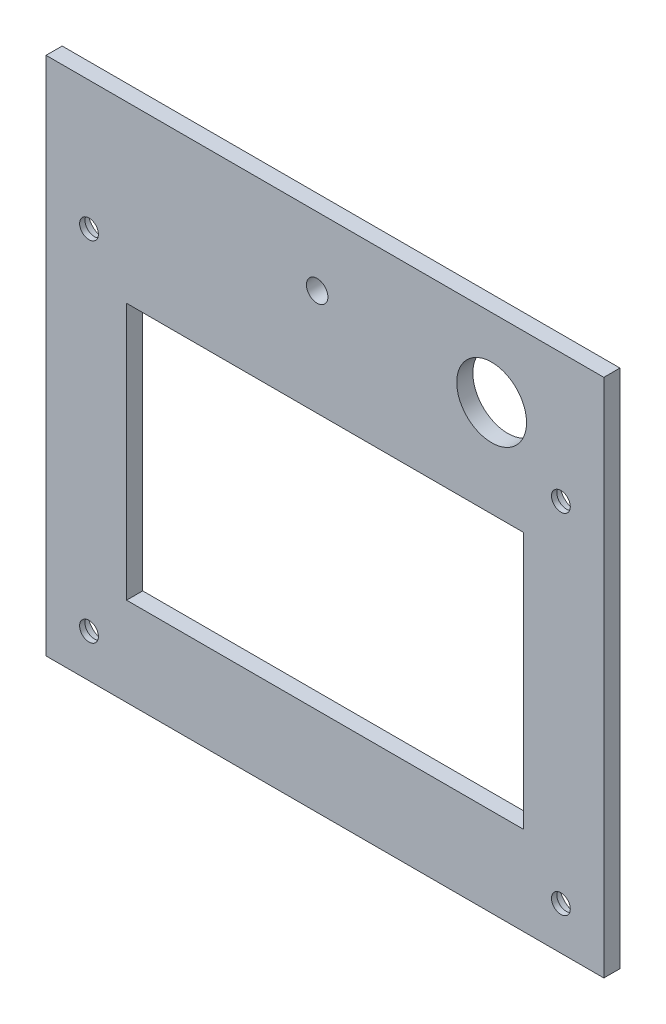
ISO-10303-21;
HEADER;
FILE_DESCRIPTION(('STEP AP214'),'2;1');
FILE_NAME('part.step','',(''),(''),'','','');
FILE_SCHEMA(('AUTOMOTIVE_DESIGN { 1 0 10303 214 1 1 1 1 }'));
ENDSEC;
DATA;
#1=APPLICATION_CONTEXT('core data for automotive mechanical design processes');
#2=APPLICATION_PROTOCOL_DEFINITION('international standard','automotive_design',2000,#1);
#3=PRODUCT_CONTEXT('',#1,'mechanical');
#4=PRODUCT('Part','Part','',(#3));
#5=PRODUCT_RELATED_PRODUCT_CATEGORY('part','',(#4));
#6=PRODUCT_DEFINITION_FORMATION('','',#4);
#7=PRODUCT_DEFINITION_CONTEXT('part definition',#1,'design');
#8=PRODUCT_DEFINITION('design','',#6,#7);
#9=PRODUCT_DEFINITION_SHAPE('','',#8);
#10=(LENGTH_UNIT() NAMED_UNIT(*) SI_UNIT(.MILLI.,.METRE.));
#11=(NAMED_UNIT(*) PLANE_ANGLE_UNIT() SI_UNIT($,.RADIAN.));
#12=(NAMED_UNIT(*) SI_UNIT($,.STERADIAN.) SOLID_ANGLE_UNIT());
#13=UNCERTAINTY_MEASURE_WITH_UNIT(LENGTH_MEASURE(1.E-05),#10,'distance_accuracy_value','');
#14=(GEOMETRIC_REPRESENTATION_CONTEXT(3) GLOBAL_UNCERTAINTY_ASSIGNED_CONTEXT((#13)) GLOBAL_UNIT_ASSIGNED_CONTEXT((#10,
#11,#12)) REPRESENTATION_CONTEXT('',''));
#15=CARTESIAN_POINT('',(0.,0.,0.));
#16=DIRECTION('',(0.,0.,1.));
#17=DIRECTION('',(1.,0.,0.));
#18=AXIS2_PLACEMENT_3D('',#15,#16,#17);
#19=CARTESIAN_POINT('',(0.,64.9,3.));
#20=DIRECTION('',(0.,0.,-1.));
#21=DIRECTION('',(-1.,0.,0.));
#22=AXIS2_PLACEMENT_3D('',#19,#20,#21);
#23=CYLINDRICAL_SURFACE('',#22,1.75);
#24=CARTESIAN_POINT('',(0.,64.9,2.));
#25=DIRECTION('',(0.,0.,-1.));
#26=DIRECTION('',(-1.,0.,0.));
#27=AXIS2_PLACEMENT_3D('',#24,#25,#26);
#28=CIRCLE('',#27,1.75);
#29=CARTESIAN_POINT('',(-1.75,64.9,2.));
#30=VERTEX_POINT('',#29);
#31=EDGE_CURVE('E36',#30,#30,#28,.T.);
#32=ORIENTED_EDGE('',*,*,#31,.T.);
#33=EDGE_LOOP('',(#32));
#34=FACE_BOUND('',#33,.T.);
#35=CARTESIAN_POINT('',(0.,64.9,3.));
#36=DIRECTION('',(0.,0.,1.));
#37=DIRECTION('',(1.,0.,0.));
#38=AXIS2_PLACEMENT_3D('',#35,#36,#37);
#39=CIRCLE('',#38,1.75);
#40=CARTESIAN_POINT('',(1.75,64.9,3.));
#41=VERTEX_POINT('',#40);
#42=EDGE_CURVE('E290',#41,#41,#39,.T.);
#43=ORIENTED_EDGE('',*,*,#42,.T.);
#44=EDGE_LOOP('',(#43));
#45=FACE_BOUND('',#44,.T.);
#46=ADVANCED_FACE('F32',(#34,#45),#23,.F.);
#47=CARTESIAN_POINT('',(87.9,64.9,3.));
#48=DIRECTION('',(0.,0.,-1.));
#49=DIRECTION('',(-1.,0.,0.));
#50=AXIS2_PLACEMENT_3D('',#47,#48,#49);
#51=CYLINDRICAL_SURFACE('',#50,1.75);
#52=CARTESIAN_POINT('',(87.9,64.9,2.));
#53=DIRECTION('',(0.,0.,-1.));
#54=DIRECTION('',(-1.,0.,0.));
#55=AXIS2_PLACEMENT_3D('',#52,#53,#54);
#56=CIRCLE('',#55,1.75);
#57=CARTESIAN_POINT('',(86.15,64.9,2.));
#58=VERTEX_POINT('',#57);
#59=EDGE_CURVE('E201',#58,#58,#56,.T.);
#60=ORIENTED_EDGE('',*,*,#59,.T.);
#61=EDGE_LOOP('',(#60));
#62=FACE_BOUND('',#61,.T.);
#63=CARTESIAN_POINT('',(87.9,64.9,3.));
#64=DIRECTION('',(0.,0.,1.));
#65=DIRECTION('',(1.,0.,0.));
#66=AXIS2_PLACEMENT_3D('',#63,#64,#65);
#67=CIRCLE('',#66,1.75);
#68=CARTESIAN_POINT('',(89.65,64.9,3.));
#69=VERTEX_POINT('',#68);
#70=EDGE_CURVE('E283',#69,#69,#67,.T.);
#71=ORIENTED_EDGE('',*,*,#70,.T.);
#72=EDGE_LOOP('',(#71));
#73=FACE_BOUND('',#72,.T.);
#74=ADVANCED_FACE('F255',(#62,#73),#51,.F.);
#75=CARTESIAN_POINT('',(87.9,0.,3.));
#76=DIRECTION('',(0.,0.,-1.));
#77=DIRECTION('',(-1.,0.,0.));
#78=AXIS2_PLACEMENT_3D('',#75,#76,#77);
#79=CYLINDRICAL_SURFACE('',#78,1.75);
#80=CARTESIAN_POINT('',(87.9,0.,2.));
#81=DIRECTION('',(0.,0.,-1.));
#82=DIRECTION('',(-1.,0.,0.));
#83=AXIS2_PLACEMENT_3D('',#80,#81,#82);
#84=CIRCLE('',#83,1.75);
#85=CARTESIAN_POINT('',(86.15,0.,2.));
#86=VERTEX_POINT('',#85);
#87=EDGE_CURVE('E199',#86,#86,#84,.T.);
#88=ORIENTED_EDGE('',*,*,#87,.T.);
#89=EDGE_LOOP('',(#88));
#90=FACE_BOUND('',#89,.T.);
#91=CARTESIAN_POINT('',(87.9,0.,3.));
#92=DIRECTION('',(0.,0.,1.));
#93=DIRECTION('',(1.,0.,0.));
#94=AXIS2_PLACEMENT_3D('',#91,#92,#93);
#95=CIRCLE('',#94,1.75);
#96=CARTESIAN_POINT('',(89.65,0.,3.));
#97=VERTEX_POINT('',#96);
#98=EDGE_CURVE('E279',#97,#97,#95,.T.);
#99=ORIENTED_EDGE('',*,*,#98,.T.);
#100=EDGE_LOOP('',(#99));
#101=FACE_BOUND('',#100,.T.);
#102=ADVANCED_FACE('F260',(#90,#101),#79,.F.);
#103=CARTESIAN_POINT('',(0.,0.,3.));
#104=DIRECTION('',(0.,0.,-1.));
#105=DIRECTION('',(-1.,0.,0.));
#106=AXIS2_PLACEMENT_3D('',#103,#104,#105);
#107=CYLINDRICAL_SURFACE('',#106,1.75);
#108=CARTESIAN_POINT('',(0.,0.,2.));
#109=DIRECTION('',(0.,0.,-1.));
#110=DIRECTION('',(-1.,0.,0.));
#111=AXIS2_PLACEMENT_3D('',#108,#109,#110);
#112=CIRCLE('',#111,1.75);
#113=CARTESIAN_POINT('',(-1.75,0.,2.));
#114=VERTEX_POINT('',#113);
#115=EDGE_CURVE('E145',#114,#114,#112,.T.);
#116=ORIENTED_EDGE('',*,*,#115,.T.);
#117=EDGE_LOOP('',(#116));
#118=FACE_BOUND('',#117,.T.);
#119=CARTESIAN_POINT('',(0.,0.,3.));
#120=DIRECTION('',(0.,0.,1.));
#121=DIRECTION('',(1.,0.,0.));
#122=AXIS2_PLACEMENT_3D('',#119,#120,#121);
#123=CIRCLE('',#122,1.75);
#124=CARTESIAN_POINT('',(1.75,0.,3.));
#125=VERTEX_POINT('',#124);
#126=EDGE_CURVE('E287',#125,#125,#123,.T.);
#127=ORIENTED_EDGE('',*,*,#126,.T.);
#128=EDGE_LOOP('',(#127));
#129=FACE_BOUND('',#128,.T.);
#130=ADVANCED_FACE('F315',(#118,#129),#107,.F.);
#131=CARTESIAN_POINT('',(95.9,0.,0.));
#132=DIRECTION('',(1.,0.,0.));
#133=DIRECTION('',(0.,0.,-1.));
#134=AXIS2_PLACEMENT_3D('',#131,#132,#133);
#135=PLANE('',#134);
#136=DIRECTION('',(0.,0.,-1.));
#137=VECTOR('',#136,1.);
#138=CARTESIAN_POINT('',(95.9,88.9,15.));
#139=LINE('',#138,#137);
#140=CARTESIAN_POINT('',(95.9,88.9,3.));
#141=VERTEX_POINT('',#140);
#142=CARTESIAN_POINT('',(95.9,88.9,0.));
#143=VERTEX_POINT('',#142);
#144=EDGE_CURVE('E123',#141,#143,#139,.T.);
#145=ORIENTED_EDGE('',*,*,#144,.F.);
#146=DIRECTION('',(0.,-1.,0.));
#147=VECTOR('',#146,1.);
#148=CARTESIAN_POINT('',(95.9,0.,3.));
#149=LINE('',#148,#147);
#150=CARTESIAN_POINT('',(95.9,-8.,3.));
#151=VERTEX_POINT('',#150);
#152=EDGE_CURVE('E49',#141,#151,#149,.T.);
#153=ORIENTED_EDGE('',*,*,#152,.T.);
#154=DIRECTION('',(0.,0.,1.));
#155=VECTOR('',#154,1.);
#156=CARTESIAN_POINT('',(95.9,-8.,0.));
#157=LINE('',#156,#155);
#158=CARTESIAN_POINT('',(95.9,-8.,0.));
#159=VERTEX_POINT('',#158);
#160=EDGE_CURVE('E148',#159,#151,#157,.T.);
#161=ORIENTED_EDGE('',*,*,#160,.F.);
#162=DIRECTION('',(0.,1.,0.));
#163=VECTOR('',#162,1.);
#164=CARTESIAN_POINT('',(95.9,-5.,0.));
#165=LINE('',#164,#163);
#166=EDGE_CURVE('E157',#159,#143,#165,.T.);
#167=ORIENTED_EDGE('',*,*,#166,.T.);
#168=EDGE_LOOP('',(#145,#153,#161,#167));
#169=FACE_BOUND('',#168,.T.);
#170=ADVANCED_FACE('F300',(#169),#135,.T.);
#171=CARTESIAN_POINT('',(-8.,0.,0.));
#172=DIRECTION('',(1.,0.,0.));
#173=DIRECTION('',(0.,0.,-1.));
#174=AXIS2_PLACEMENT_3D('',#171,#172,#173);
#175=PLANE('',#174);
#176=DIRECTION('',(0.,-1.,0.));
#177=VECTOR('',#176,1.);
#178=CARTESIAN_POINT('',(-8.,0.,3.));
#179=LINE('',#178,#177);
#180=CARTESIAN_POINT('',(-8.,88.9,3.));
#181=VERTEX_POINT('',#180);
#182=CARTESIAN_POINT('',(-8.,-8.,3.));
#183=VERTEX_POINT('',#182);
#184=EDGE_CURVE('E100',#181,#183,#179,.T.);
#185=ORIENTED_EDGE('',*,*,#184,.F.);
#186=DIRECTION('',(0.,0.,1.));
#187=VECTOR('',#186,1.);
#188=CARTESIAN_POINT('',(-8.,88.9,15.));
#189=LINE('',#188,#187);
#190=CARTESIAN_POINT('',(-8.,88.9,0.));
#191=VERTEX_POINT('',#190);
#192=EDGE_CURVE('E111',#191,#181,#189,.T.);
#193=ORIENTED_EDGE('',*,*,#192,.F.);
#194=DIRECTION('',(0.,-1.,0.));
#195=VECTOR('',#194,1.);
#196=CARTESIAN_POINT('',(-8.,-5.,0.));
#197=LINE('',#196,#195);
#198=CARTESIAN_POINT('',(-8.,-8.,0.));
#199=VERTEX_POINT('',#198);
#200=EDGE_CURVE('E155',#191,#199,#197,.T.);
#201=ORIENTED_EDGE('',*,*,#200,.T.);
#202=DIRECTION('',(0.,0.,-1.));
#203=VECTOR('',#202,1.);
#204=CARTESIAN_POINT('',(-8.,-8.,0.));
#205=LINE('',#204,#203);
#206=EDGE_CURVE('E112',#183,#199,#205,.T.);
#207=ORIENTED_EDGE('',*,*,#206,.F.);
#208=EDGE_LOOP('',(#185,#193,#201,#207));
#209=FACE_BOUND('',#208,.T.);
#210=ADVANCED_FACE('F109',(#209),#175,.F.);
#211=CARTESIAN_POINT('',(0.,-8.,0.));
#212=DIRECTION('',(0.,-1.,0.));
#213=DIRECTION('',(0.,0.,-1.));
#214=AXIS2_PLACEMENT_3D('',#211,#212,#213);
#215=PLANE('',#214);
#216=ORIENTED_EDGE('',*,*,#160,.T.);
#217=DIRECTION('',(-1.,0.,0.));
#218=VECTOR('',#217,1.);
#219=CARTESIAN_POINT('',(0.,-8.,3.));
#220=LINE('',#219,#218);
#221=EDGE_CURVE('E296',#151,#183,#220,.T.);
#222=ORIENTED_EDGE('',*,*,#221,.T.);
#223=ORIENTED_EDGE('',*,*,#206,.T.);
#224=DIRECTION('',(1.,0.,0.));
#225=VECTOR('',#224,1.);
#226=CARTESIAN_POINT('',(95.9,-8.,0.));
#227=LINE('',#226,#225);
#228=EDGE_CURVE('E152',#199,#159,#227,.T.);
#229=ORIENTED_EDGE('',*,*,#228,.T.);
#230=EDGE_LOOP('',(#216,#222,#223,#229));
#231=FACE_BOUND('',#230,.T.);
#232=ADVANCED_FACE('F268',(#231),#215,.T.);
#233=CARTESIAN_POINT('',(0.,88.9,0.));
#234=DIRECTION('',(0.,1.,0.));
#235=DIRECTION('',(0.,0.,1.));
#236=AXIS2_PLACEMENT_3D('',#233,#234,#235);
#237=PLANE('',#236);
#238=ORIENTED_EDGE('',*,*,#192,.T.);
#239=DIRECTION('',(1.,0.,0.));
#240=VECTOR('',#239,1.);
#241=CARTESIAN_POINT('',(0.,88.9,3.));
#242=LINE('',#241,#240);
#243=EDGE_CURVE('E97',#181,#141,#242,.T.);
#244=ORIENTED_EDGE('',*,*,#243,.T.);
#245=ORIENTED_EDGE('',*,*,#144,.T.);
#246=DIRECTION('',(-1.,0.,0.));
#247=VECTOR('',#246,1.);
#248=CARTESIAN_POINT('',(95.9,88.9,0.));
#249=LINE('',#248,#247);
#250=EDGE_CURVE('E117',#143,#191,#249,.T.);
#251=ORIENTED_EDGE('',*,*,#250,.T.);
#252=EDGE_LOOP('',(#238,#244,#245,#251));
#253=FACE_BOUND('',#252,.T.);
#254=ADVANCED_FACE('F115',(#253),#237,.T.);
#255=CARTESIAN_POINT('',(0.,0.,3.));
#256=DIRECTION('',(0.,0.,1.));
#257=DIRECTION('',(1.,0.,0.));
#258=AXIS2_PLACEMENT_3D('',#255,#256,#257);
#259=PLANE('',#258);
#260=DIRECTION('',(1.,0.,0.));
#261=VECTOR('',#260,1.);
#262=CARTESIAN_POINT('',(82.9,8.5,3.));
#263=LINE('',#262,#261);
#264=CARTESIAN_POINT('',(7.,8.49999999999999,3.));
#265=VERTEX_POINT('',#264);
#266=CARTESIAN_POINT('',(80.9,8.5,3.));
#267=VERTEX_POINT('',#266);
#268=EDGE_CURVE('E41',#265,#267,#263,.T.);
#269=ORIENTED_EDGE('',*,*,#268,.F.);
#270=DIRECTION('',(0.,1.,0.));
#271=VECTOR('',#270,1.);
#272=CARTESIAN_POINT('',(7.,8.49999999999999,3.));
#273=LINE('',#272,#271);
#274=CARTESIAN_POINT('',(7.,56.4,3.));
#275=VERTEX_POINT('',#274);
#276=EDGE_CURVE('E160',#265,#275,#273,.T.);
#277=ORIENTED_EDGE('',*,*,#276,.T.);
#278=DIRECTION('',(-1.,0.,0.));
#279=VECTOR('',#278,1.);
#280=CARTESIAN_POINT('',(82.9,56.4,3.));
#281=LINE('',#280,#279);
#282=CARTESIAN_POINT('',(80.9,56.4,3.));
#283=VERTEX_POINT('',#282);
#284=EDGE_CURVE('E11',#283,#275,#281,.T.);
#285=ORIENTED_EDGE('',*,*,#284,.F.);
#286=DIRECTION('',(0.,-1.,0.));
#287=VECTOR('',#286,1.);
#288=CARTESIAN_POINT('',(80.9,8.5,3.));
#289=LINE('',#288,#287);
#290=EDGE_CURVE('E163',#283,#267,#289,.T.);
#291=ORIENTED_EDGE('',*,*,#290,.T.);
#292=EDGE_LOOP('',(#269,#277,#285,#291));
#293=FACE_BOUND('',#292,.T.);
#294=CARTESIAN_POINT('',(75.,74.4,3.));
#295=DIRECTION('',(0.,0.,1.));
#296=DIRECTION('',(1.,0.,0.));
#297=AXIS2_PLACEMENT_3D('',#294,#295,#296);
#298=CIRCLE('',#297,6.5);
#299=CARTESIAN_POINT('',(81.5,74.4,3.));
#300=VERTEX_POINT('',#299);
#301=EDGE_CURVE('E186',#300,#300,#298,.T.);
#302=ORIENTED_EDGE('',*,*,#301,.F.);
#303=EDGE_LOOP('',(#302));
#304=FACE_BOUND('',#303,.T.);
#305=CARTESIAN_POINT('',(42.5,76.15,3.));
#306=DIRECTION('',(0.,0.,1.));
#307=DIRECTION('',(1.,0.,0.));
#308=AXIS2_PLACEMENT_3D('',#305,#306,#307);
#309=CIRCLE('',#308,2.);
#310=CARTESIAN_POINT('',(44.5,76.15,3.));
#311=VERTEX_POINT('',#310);
#312=EDGE_CURVE('E180',#311,#311,#309,.T.);
#313=ORIENTED_EDGE('',*,*,#312,.F.);
#314=EDGE_LOOP('',(#313));
#315=FACE_BOUND('',#314,.T.);
#316=ORIENTED_EDGE('',*,*,#98,.F.);
#317=EDGE_LOOP('',(#316));
#318=FACE_BOUND('',#317,.T.);
#319=ORIENTED_EDGE('',*,*,#70,.F.);
#320=EDGE_LOOP('',(#319));
#321=FACE_BOUND('',#320,.T.);
#322=ORIENTED_EDGE('',*,*,#126,.F.);
#323=EDGE_LOOP('',(#322));
#324=FACE_BOUND('',#323,.T.);
#325=ORIENTED_EDGE('',*,*,#42,.F.);
#326=EDGE_LOOP('',(#325));
#327=FACE_BOUND('',#326,.T.);
#328=ORIENTED_EDGE('',*,*,#152,.F.);
#329=ORIENTED_EDGE('',*,*,#243,.F.);
#330=ORIENTED_EDGE('',*,*,#184,.T.);
#331=ORIENTED_EDGE('',*,*,#221,.F.);
#332=EDGE_LOOP('',(#328,#329,#330,#331));
#333=FACE_BOUND('',#332,.T.);
#334=ADVANCED_FACE('F99',(#293,#304,#315,#318,#321,#324,#327,#333),#259,.T.);
#335=CARTESIAN_POINT('',(0.,0.,0.));
#336=DIRECTION('',(0.,0.,1.));
#337=DIRECTION('',(1.,0.,0.));
#338=AXIS2_PLACEMENT_3D('',#335,#336,#337);
#339=PLANE('',#338);
#340=ORIENTED_EDGE('',*,*,#228,.F.);
#341=ORIENTED_EDGE('',*,*,#200,.F.);
#342=ORIENTED_EDGE('',*,*,#250,.F.);
#343=ORIENTED_EDGE('',*,*,#166,.F.);
#344=EDGE_LOOP('',(#340,#341,#342,#343));
#345=FACE_BOUND('',#344,.T.);
#346=CARTESIAN_POINT('',(0.,64.9,0.));
#347=DIRECTION('',(0.,0.,-1.));
#348=DIRECTION('',(-1.,0.,0.));
#349=AXIS2_PLACEMENT_3D('',#346,#347,#348);
#350=CIRCLE('',#349,3.25);
#351=CARTESIAN_POINT('',(-3.25,64.9,0.));
#352=VERTEX_POINT('',#351);
#353=EDGE_CURVE('E118',#352,#352,#350,.T.);
#354=ORIENTED_EDGE('',*,*,#353,.F.);
#355=EDGE_LOOP('',(#354));
#356=FACE_BOUND('',#355,.T.);
#357=CARTESIAN_POINT('',(87.9,64.9,0.));
#358=DIRECTION('',(0.,0.,-1.));
#359=DIRECTION('',(-1.,0.,0.));
#360=AXIS2_PLACEMENT_3D('',#357,#358,#359);
#361=CIRCLE('',#360,3.24999999999999);
#362=CARTESIAN_POINT('',(84.65,64.9,0.));
#363=VERTEX_POINT('',#362);
#364=EDGE_CURVE('E137',#363,#363,#361,.T.);
#365=ORIENTED_EDGE('',*,*,#364,.F.);
#366=EDGE_LOOP('',(#365));
#367=FACE_BOUND('',#366,.T.);
#368=CARTESIAN_POINT('',(87.9,0.,0.));
#369=DIRECTION('',(0.,0.,-1.));
#370=DIRECTION('',(-1.,0.,0.));
#371=AXIS2_PLACEMENT_3D('',#368,#369,#370);
#372=CIRCLE('',#371,3.25000000000001);
#373=CARTESIAN_POINT('',(84.65,0.,0.));
#374=VERTEX_POINT('',#373);
#375=EDGE_CURVE('E131',#374,#374,#372,.T.);
#376=ORIENTED_EDGE('',*,*,#375,.F.);
#377=EDGE_LOOP('',(#376));
#378=FACE_BOUND('',#377,.T.);
#379=CARTESIAN_POINT('',(0.,0.,0.));
#380=DIRECTION('',(0.,0.,-1.));
#381=DIRECTION('',(-1.,0.,0.));
#382=AXIS2_PLACEMENT_3D('',#379,#380,#381);
#383=CIRCLE('',#382,3.25);
#384=CARTESIAN_POINT('',(-3.25,0.,0.));
#385=VERTEX_POINT('',#384);
#386=EDGE_CURVE('E130',#385,#385,#383,.T.);
#387=ORIENTED_EDGE('',*,*,#386,.F.);
#388=EDGE_LOOP('',(#387));
#389=FACE_BOUND('',#388,.T.);
#390=DIRECTION('',(0.,-1.,0.));
#391=VECTOR('',#390,1.);
#392=CARTESIAN_POINT('',(7.,8.49999999999999,0.));
#393=LINE('',#392,#391);
#394=CARTESIAN_POINT('',(7.,56.4,0.));
#395=VERTEX_POINT('',#394);
#396=CARTESIAN_POINT('',(7.,8.49999999999999,0.));
#397=VERTEX_POINT('',#396);
#398=EDGE_CURVE('E161',#395,#397,#393,.T.);
#399=ORIENTED_EDGE('',*,*,#398,.T.);
#400=DIRECTION('',(1.,0.,0.));
#401=VECTOR('',#400,1.);
#402=CARTESIAN_POINT('',(82.9,8.5,0.));
#403=LINE('',#402,#401);
#404=CARTESIAN_POINT('',(80.9,8.5,0.));
#405=VERTEX_POINT('',#404);
#406=EDGE_CURVE('E189',#397,#405,#403,.T.);
#407=ORIENTED_EDGE('',*,*,#406,.T.);
#408=DIRECTION('',(0.,1.,0.));
#409=VECTOR('',#408,1.);
#410=CARTESIAN_POINT('',(80.9,8.5,0.));
#411=LINE('',#410,#409);
#412=CARTESIAN_POINT('',(80.9,56.4,0.));
#413=VERTEX_POINT('',#412);
#414=EDGE_CURVE('E171',#405,#413,#411,.T.);
#415=ORIENTED_EDGE('',*,*,#414,.T.);
#416=DIRECTION('',(-1.,0.,0.));
#417=VECTOR('',#416,1.);
#418=CARTESIAN_POINT('',(82.9,56.4,0.));
#419=LINE('',#418,#417);
#420=EDGE_CURVE('E192',#413,#395,#419,.T.);
#421=ORIENTED_EDGE('',*,*,#420,.T.);
#422=EDGE_LOOP('',(#399,#407,#415,#421));
#423=FACE_BOUND('',#422,.T.);
#424=CARTESIAN_POINT('',(75.,74.4,0.));
#425=DIRECTION('',(0.,0.,1.));
#426=DIRECTION('',(1.,0.,0.));
#427=AXIS2_PLACEMENT_3D('',#424,#425,#426);
#428=CIRCLE('',#427,6.5);
#429=CARTESIAN_POINT('',(81.5,74.4,0.));
#430=VERTEX_POINT('',#429);
#431=EDGE_CURVE('E183',#430,#430,#428,.T.);
#432=ORIENTED_EDGE('',*,*,#431,.T.);
#433=EDGE_LOOP('',(#432));
#434=FACE_BOUND('',#433,.T.);
#435=CARTESIAN_POINT('',(42.5,76.15,0.));
#436=DIRECTION('',(0.,0.,1.));
#437=DIRECTION('',(1.,0.,0.));
#438=AXIS2_PLACEMENT_3D('',#435,#436,#437);
#439=CIRCLE('',#438,2.);
#440=CARTESIAN_POINT('',(44.5,76.15,0.));
#441=VERTEX_POINT('',#440);
#442=EDGE_CURVE('E173',#441,#441,#439,.T.);
#443=ORIENTED_EDGE('',*,*,#442,.T.);
#444=EDGE_LOOP('',(#443));
#445=FACE_BOUND('',#444,.T.);
#446=ADVANCED_FACE('F34',(#345,#356,#367,#378,#389,#423,#434,#445),#339,.F.);
#447=CARTESIAN_POINT('',(82.9,8.5,3.));
#448=DIRECTION('',(0.,1.,0.));
#449=DIRECTION('',(-1.,0.,0.));
#450=AXIS2_PLACEMENT_3D('',#447,#448,#449);
#451=PLANE('',#450);
#452=DIRECTION('',(0.,0.,1.));
#453=VECTOR('',#452,1.);
#454=CARTESIAN_POINT('',(7.,8.49999999999999,-47.9417354712989));
#455=LINE('',#454,#453);
#456=EDGE_CURVE('E167',#397,#265,#455,.T.);
#457=ORIENTED_EDGE('',*,*,#456,.T.);
#458=ORIENTED_EDGE('',*,*,#268,.T.);
#459=DIRECTION('',(0.,0.,1.));
#460=VECTOR('',#459,1.);
#461=CARTESIAN_POINT('',(80.9,8.5,-47.9417354712989));
#462=LINE('',#461,#460);
#463=EDGE_CURVE('E174',#405,#267,#462,.T.);
#464=ORIENTED_EDGE('',*,*,#463,.F.);
#465=ORIENTED_EDGE('',*,*,#406,.F.);
#466=EDGE_LOOP('',(#457,#458,#464,#465));
#467=FACE_BOUND('',#466,.T.);
#468=ADVANCED_FACE('F225',(#467),#451,.T.);
#469=CARTESIAN_POINT('',(82.9,56.4,3.));
#470=DIRECTION('',(0.,-1.,0.));
#471=DIRECTION('',(0.,0.,-1.));
#472=AXIS2_PLACEMENT_3D('',#469,#470,#471);
#473=PLANE('',#472);
#474=DIRECTION('',(0.,0.,1.));
#475=VECTOR('',#474,1.);
#476=CARTESIAN_POINT('',(7.,56.4,-47.9417354712989));
#477=LINE('',#476,#475);
#478=EDGE_CURVE('E164',#395,#275,#477,.T.);
#479=ORIENTED_EDGE('',*,*,#478,.F.);
#480=ORIENTED_EDGE('',*,*,#420,.F.);
#481=DIRECTION('',(0.,0.,1.));
#482=VECTOR('',#481,1.);
#483=CARTESIAN_POINT('',(80.9,56.4,-47.9417354712989));
#484=LINE('',#483,#482);
#485=EDGE_CURVE('E57',#413,#283,#484,.T.);
#486=ORIENTED_EDGE('',*,*,#485,.T.);
#487=ORIENTED_EDGE('',*,*,#284,.T.);
#488=EDGE_LOOP('',(#479,#480,#486,#487));
#489=FACE_BOUND('',#488,.T.);
#490=ADVANCED_FACE('F251',(#489),#473,.T.);
#491=CARTESIAN_POINT('',(75.,74.4,3.));
#492=DIRECTION('',(0.,0.,-1.));
#493=DIRECTION('',(-1.,0.,0.));
#494=AXIS2_PLACEMENT_3D('',#491,#492,#493);
#495=CYLINDRICAL_SURFACE('',#494,6.5);
#496=ORIENTED_EDGE('',*,*,#301,.T.);
#497=EDGE_LOOP('',(#496));
#498=FACE_BOUND('',#497,.T.);
#499=ORIENTED_EDGE('',*,*,#431,.F.);
#500=EDGE_LOOP('',(#499));
#501=FACE_BOUND('',#500,.T.);
#502=ADVANCED_FACE('F242',(#498,#501),#495,.F.);
#503=CARTESIAN_POINT('',(42.5,76.15,3.));
#504=DIRECTION('',(0.,0.,-1.));
#505=DIRECTION('',(-1.,0.,0.));
#506=AXIS2_PLACEMENT_3D('',#503,#504,#505);
#507=CYLINDRICAL_SURFACE('',#506,2.);
#508=ORIENTED_EDGE('',*,*,#312,.T.);
#509=EDGE_LOOP('',(#508));
#510=FACE_BOUND('',#509,.T.);
#511=ORIENTED_EDGE('',*,*,#442,.F.);
#512=EDGE_LOOP('',(#511));
#513=FACE_BOUND('',#512,.T.);
#514=ADVANCED_FACE('F239',(#510,#513),#507,.F.);
#515=CARTESIAN_POINT('',(80.9,8.5,-47.9417354712989));
#516=DIRECTION('',(-1.,0.,0.));
#517=DIRECTION('',(0.,0.,1.));
#518=AXIS2_PLACEMENT_3D('',#515,#516,#517);
#519=PLANE('',#518);
#520=ORIENTED_EDGE('',*,*,#414,.F.);
#521=ORIENTED_EDGE('',*,*,#463,.T.);
#522=ORIENTED_EDGE('',*,*,#290,.F.);
#523=ORIENTED_EDGE('',*,*,#485,.F.);
#524=EDGE_LOOP('',(#520,#521,#522,#523));
#525=FACE_BOUND('',#524,.T.);
#526=ADVANCED_FACE('F241',(#525),#519,.T.);
#527=CARTESIAN_POINT('',(7.,8.49999999999999,-47.9417354712989));
#528=DIRECTION('',(1.,0.,0.));
#529=DIRECTION('',(0.,0.,-1.));
#530=AXIS2_PLACEMENT_3D('',#527,#528,#529);
#531=PLANE('',#530);
#532=ORIENTED_EDGE('',*,*,#398,.F.);
#533=ORIENTED_EDGE('',*,*,#478,.T.);
#534=ORIENTED_EDGE('',*,*,#276,.F.);
#535=ORIENTED_EDGE('',*,*,#456,.F.);
#536=EDGE_LOOP('',(#532,#533,#534,#535));
#537=FACE_BOUND('',#536,.T.);
#538=ADVANCED_FACE('F249',(#537),#531,.T.);
#539=CARTESIAN_POINT('',(0.,0.,2.));
#540=DIRECTION('',(0.,0.,-1.));
#541=DIRECTION('',(-1.,0.,0.));
#542=AXIS2_PLACEMENT_3D('',#539,#540,#541);
#543=CYLINDRICAL_SURFACE('',#542,3.25);
#544=CARTESIAN_POINT('',(0.,0.,2.));
#545=DIRECTION('',(0.,0.,-1.));
#546=DIRECTION('',(-1.,0.,0.));
#547=AXIS2_PLACEMENT_3D('',#544,#545,#546);
#548=CIRCLE('',#547,3.25);
#549=CARTESIAN_POINT('',(-3.25,0.,2.));
#550=VERTEX_POINT('',#549);
#551=EDGE_CURVE('E142',#550,#550,#548,.T.);
#552=ORIENTED_EDGE('',*,*,#551,.F.);
#553=EDGE_LOOP('',(#552));
#554=FACE_BOUND('',#553,.T.);
#555=ORIENTED_EDGE('',*,*,#386,.T.);
#556=EDGE_LOOP('',(#555));
#557=FACE_BOUND('',#556,.T.);
#558=ADVANCED_FACE('F310',(#554,#557),#543,.F.);
#559=CARTESIAN_POINT('',(0.,0.,2.));
#560=DIRECTION('',(0.,0.,-1.));
#561=DIRECTION('',(-1.,0.,0.));
#562=AXIS2_PLACEMENT_3D('',#559,#560,#561);
#563=PLANE('',#562);
#564=ORIENTED_EDGE('',*,*,#115,.F.);
#565=EDGE_LOOP('',(#564));
#566=FACE_BOUND('',#565,.T.);
#567=ORIENTED_EDGE('',*,*,#551,.T.);
#568=EDGE_LOOP('',(#567));
#569=FACE_BOUND('',#568,.T.);
#570=ADVANCED_FACE('F321',(#566,#569),#563,.T.);
#571=CARTESIAN_POINT('',(87.9,0.,2.));
#572=DIRECTION('',(0.,0.,-1.));
#573=DIRECTION('',(-1.,0.,0.));
#574=AXIS2_PLACEMENT_3D('',#571,#572,#573);
#575=CYLINDRICAL_SURFACE('',#574,3.25000000000001);
#576=CARTESIAN_POINT('',(87.9,0.,2.));
#577=DIRECTION('',(0.,0.,-1.));
#578=DIRECTION('',(-1.,0.,0.));
#579=AXIS2_PLACEMENT_3D('',#576,#577,#578);
#580=CIRCLE('',#579,3.25000000000001);
#581=CARTESIAN_POINT('',(84.65,0.,2.));
#582=VERTEX_POINT('',#581);
#583=EDGE_CURVE('E127',#582,#582,#580,.T.);
#584=ORIENTED_EDGE('',*,*,#583,.F.);
#585=EDGE_LOOP('',(#584));
#586=FACE_BOUND('',#585,.T.);
#587=ORIENTED_EDGE('',*,*,#375,.T.);
#588=EDGE_LOOP('',(#587));
#589=FACE_BOUND('',#588,.T.);
#590=ADVANCED_FACE('F350',(#586,#589),#575,.F.);
#591=CARTESIAN_POINT('',(87.9,0.,2.));
#592=DIRECTION('',(0.,0.,-1.));
#593=DIRECTION('',(-1.,0.,0.));
#594=AXIS2_PLACEMENT_3D('',#591,#592,#593);
#595=PLANE('',#594);
#596=ORIENTED_EDGE('',*,*,#87,.F.);
#597=EDGE_LOOP('',(#596));
#598=FACE_BOUND('',#597,.T.);
#599=ORIENTED_EDGE('',*,*,#583,.T.);
#600=EDGE_LOOP('',(#599));
#601=FACE_BOUND('',#600,.T.);
#602=ADVANCED_FACE('F346',(#598,#601),#595,.T.);
#603=CARTESIAN_POINT('',(87.9,64.9,2.));
#604=DIRECTION('',(0.,0.,-1.));
#605=DIRECTION('',(-1.,0.,0.));
#606=AXIS2_PLACEMENT_3D('',#603,#604,#605);
#607=CYLINDRICAL_SURFACE('',#606,3.24999999999999);
#608=CARTESIAN_POINT('',(87.9,64.9,2.));
#609=DIRECTION('',(0.,0.,-1.));
#610=DIRECTION('',(-1.,0.,0.));
#611=AXIS2_PLACEMENT_3D('',#608,#609,#610);
#612=CIRCLE('',#611,3.24999999999999);
#613=CARTESIAN_POINT('',(84.65,64.9,2.));
#614=VERTEX_POINT('',#613);
#615=EDGE_CURVE('E134',#614,#614,#612,.T.);
#616=ORIENTED_EDGE('',*,*,#615,.F.);
#617=EDGE_LOOP('',(#616));
#618=FACE_BOUND('',#617,.T.);
#619=ORIENTED_EDGE('',*,*,#364,.T.);
#620=EDGE_LOOP('',(#619));
#621=FACE_BOUND('',#620,.T.);
#622=ADVANCED_FACE('F349',(#618,#621),#607,.F.);
#623=CARTESIAN_POINT('',(87.9,64.9,2.));
#624=DIRECTION('',(0.,0.,-1.));
#625=DIRECTION('',(-1.,0.,0.));
#626=AXIS2_PLACEMENT_3D('',#623,#624,#625);
#627=PLANE('',#626);
#628=ORIENTED_EDGE('',*,*,#59,.F.);
#629=EDGE_LOOP('',(#628));
#630=FACE_BOUND('',#629,.T.);
#631=ORIENTED_EDGE('',*,*,#615,.T.);
#632=EDGE_LOOP('',(#631));
#633=FACE_BOUND('',#632,.T.);
#634=ADVANCED_FACE('F219',(#630,#633),#627,.T.);
#635=CARTESIAN_POINT('',(0.,64.9,2.));
#636=DIRECTION('',(0.,0.,-1.));
#637=DIRECTION('',(-1.,0.,0.));
#638=AXIS2_PLACEMENT_3D('',#635,#636,#637);
#639=CYLINDRICAL_SURFACE('',#638,3.25);
#640=CARTESIAN_POINT('',(0.,64.9,2.));
#641=DIRECTION('',(0.,0.,-1.));
#642=DIRECTION('',(-1.,0.,0.));
#643=AXIS2_PLACEMENT_3D('',#640,#641,#642);
#644=CIRCLE('',#643,3.25);
#645=CARTESIAN_POINT('',(-3.25,64.9,2.));
#646=VERTEX_POINT('',#645);
#647=EDGE_CURVE('E121',#646,#646,#644,.T.);
#648=ORIENTED_EDGE('',*,*,#647,.F.);
#649=EDGE_LOOP('',(#648));
#650=FACE_BOUND('',#649,.T.);
#651=ORIENTED_EDGE('',*,*,#353,.T.);
#652=EDGE_LOOP('',(#651));
#653=FACE_BOUND('',#652,.T.);
#654=ADVANCED_FACE('F213',(#650,#653),#639,.F.);
#655=CARTESIAN_POINT('',(0.,64.9,2.));
#656=DIRECTION('',(0.,0.,-1.));
#657=DIRECTION('',(-1.,0.,0.));
#658=AXIS2_PLACEMENT_3D('',#655,#656,#657);
#659=PLANE('',#658);
#660=ORIENTED_EDGE('',*,*,#31,.F.);
#661=EDGE_LOOP('',(#660));
#662=FACE_BOUND('',#661,.T.);
#663=ORIENTED_EDGE('',*,*,#647,.T.);
#664=EDGE_LOOP('',(#663));
#665=FACE_BOUND('',#664,.T.);
#666=ADVANCED_FACE('F210',(#662,#665),#659,.T.);
#667=CLOSED_SHELL('',(#46,#74,#102,#130,#170,#210,#232,#254,#334,#446,#468,#490,#502,#514,#526,
#538,#558,#570,#590,#602,#622,#634,#654,#666));
#668=MANIFOLD_SOLID_BREP('B2',#667);
#669=ADVANCED_BREP_SHAPE_REPRESENTATION('',(#18,#668),#14);
#670=SHAPE_DEFINITION_REPRESENTATION(#9,#669);
ENDSEC;
END-ISO-10303-21;
